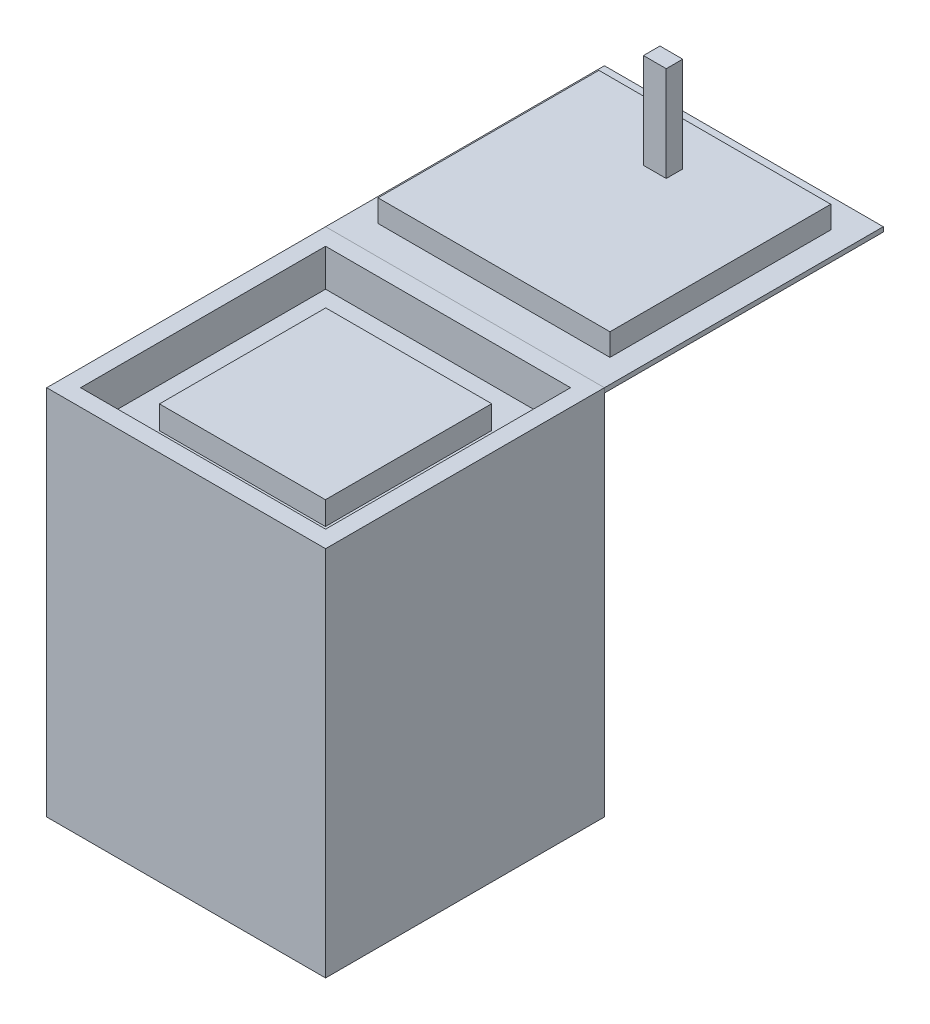
ISO-10303-21;
HEADER;
FILE_DESCRIPTION(('STEP AP214'),'2;1');
FILE_NAME('part.step','',(''),(''),'','','');
FILE_SCHEMA(('AUTOMOTIVE_DESIGN { 1 0 10303 214 1 1 1 1 }'));
ENDSEC;
DATA;
#1=APPLICATION_CONTEXT('core data for automotive mechanical design processes');
#2=APPLICATION_PROTOCOL_DEFINITION('international standard','automotive_design',2000,#1);
#3=PRODUCT_CONTEXT('',#1,'mechanical');
#4=PRODUCT('Part','Part','',(#3));
#5=PRODUCT_RELATED_PRODUCT_CATEGORY('part','',(#4));
#6=PRODUCT_DEFINITION_FORMATION('','',#4);
#7=PRODUCT_DEFINITION_CONTEXT('part definition',#1,'design');
#8=PRODUCT_DEFINITION('design','',#6,#7);
#9=PRODUCT_DEFINITION_SHAPE('','',#8);
#10=(LENGTH_UNIT() NAMED_UNIT(*) SI_UNIT(.MILLI.,.METRE.));
#11=(NAMED_UNIT(*) PLANE_ANGLE_UNIT() SI_UNIT($,.RADIAN.));
#12=(NAMED_UNIT(*) SI_UNIT($,.STERADIAN.) SOLID_ANGLE_UNIT());
#13=UNCERTAINTY_MEASURE_WITH_UNIT(LENGTH_MEASURE(1.E-05),#10,'distance_accuracy_value','');
#14=(GEOMETRIC_REPRESENTATION_CONTEXT(3) GLOBAL_UNCERTAINTY_ASSIGNED_CONTEXT((#13)) GLOBAL_UNIT_ASSIGNED_CONTEXT((#10,
#11,#12)) REPRESENTATION_CONTEXT('',''));
#15=CARTESIAN_POINT('',(0.,0.,0.));
#16=DIRECTION('',(0.,0.,1.));
#17=DIRECTION('',(1.,0.,0.));
#18=AXIS2_PLACEMENT_3D('',#15,#16,#17);
#19=CARTESIAN_POINT('',(249.5,847.834663464303,-362.405670059009));
#20=DIRECTION('',(0.,-1.,0.));
#21=DIRECTION('',(0.,0.,-1.));
#22=AXIS2_PLACEMENT_3D('',#19,#20,#21);
#23=PLANE('',#22);
#24=DIRECTION('',(-1.,0.,0.));
#25=VECTOR('',#24,1.);
#26=CARTESIAN_POINT('',(24.5,847.834663464303,-743.98579561663));
#27=LINE('',#26,#25);
#28=CARTESIAN_POINT('',(24.5,847.834663464303,-743.98579561663));
#29=VERTEX_POINT('',#28);
#30=CARTESIAN_POINT('',(-24.5,847.834663464303,-743.98579561663));
#31=VERTEX_POINT('',#30);
#32=EDGE_CURVE('E64',#29,#31,#27,.T.);
#33=ORIENTED_EDGE('',*,*,#32,.F.);
#34=DIRECTION('',(0.,0.,-1.));
#35=VECTOR('',#34,1.);
#36=CARTESIAN_POINT('',(24.5,847.834663464303,-743.98579561663));
#37=LINE('',#36,#35);
#38=CARTESIAN_POINT('',(24.5,847.834663464303,-708.477622322408));
#39=VERTEX_POINT('',#38);
#40=EDGE_CURVE('E68',#39,#29,#37,.T.);
#41=ORIENTED_EDGE('',*,*,#40,.F.);
#42=DIRECTION('',(-1.,0.,0.));
#43=VECTOR('',#42,1.);
#44=CARTESIAN_POINT('',(24.5,847.834663464303,-708.477622322408));
#45=LINE('',#44,#43);
#46=CARTESIAN_POINT('',(-24.5,847.834663464303,-708.477622322408));
#47=VERTEX_POINT('',#46);
#48=EDGE_CURVE('E138',#39,#47,#45,.T.);
#49=ORIENTED_EDGE('',*,*,#48,.T.);
#50=DIRECTION('',(0.,0.,-1.));
#51=VECTOR('',#50,1.);
#52=CARTESIAN_POINT('',(-24.5,847.834663464303,-743.98579561663));
#53=LINE('',#52,#51);
#54=EDGE_CURVE('E128',#47,#31,#53,.T.);
#55=ORIENTED_EDGE('',*,*,#54,.T.);
#56=EDGE_LOOP('',(#33,#41,#49,#55));
#57=FACE_BOUND('',#56,.T.);
#58=DIRECTION('',(0.,0.,1.));
#59=VECTOR('',#58,1.);
#60=CARTESIAN_POINT('',(-249.5,847.834663464303,-362.405670059009));
#61=LINE('',#60,#59);
#62=CARTESIAN_POINT('',(-249.5,847.834663464303,-837.594329940991));
#63=VERTEX_POINT('',#62);
#64=CARTESIAN_POINT('',(-249.5,847.834663464303,-362.405670059009));
#65=VERTEX_POINT('',#64);
#66=EDGE_CURVE('E133',#63,#65,#61,.T.);
#67=ORIENTED_EDGE('',*,*,#66,.T.);
#68=DIRECTION('',(-1.,0.,0.));
#69=VECTOR('',#68,1.);
#70=CARTESIAN_POINT('',(249.5,847.834663464303,-362.405670059009));
#71=LINE('',#70,#69);
#72=CARTESIAN_POINT('',(249.5,847.834663464303,-362.405670059009));
#73=VERTEX_POINT('',#72);
#74=EDGE_CURVE('E12',#73,#65,#71,.T.);
#75=ORIENTED_EDGE('',*,*,#74,.F.);
#76=DIRECTION('',(0.,0.,1.));
#77=VECTOR('',#76,1.);
#78=CARTESIAN_POINT('',(249.5,847.834663464303,-362.405670059009));
#79=LINE('',#78,#77);
#80=CARTESIAN_POINT('',(249.5,847.834663464303,-837.594329940991));
#81=VERTEX_POINT('',#80);
#82=EDGE_CURVE('E142',#81,#73,#79,.T.);
#83=ORIENTED_EDGE('',*,*,#82,.F.);
#84=DIRECTION('',(-1.,0.,0.));
#85=VECTOR('',#84,1.);
#86=CARTESIAN_POINT('',(249.5,847.834663464303,-837.594329940991));
#87=LINE('',#86,#85);
#88=EDGE_CURVE('E151',#81,#63,#87,.T.);
#89=ORIENTED_EDGE('',*,*,#88,.T.);
#90=EDGE_LOOP('',(#67,#75,#83,#89));
#91=FACE_BOUND('',#90,.T.);
#92=ADVANCED_FACE('F50',(#57,#91),#23,.F.);
#93=CARTESIAN_POINT('',(249.5,800.,-362.405670059009));
#94=DIRECTION('',(0.,0.,-1.));
#95=DIRECTION('',(-1.,0.,0.));
#96=AXIS2_PLACEMENT_3D('',#93,#94,#95);
#97=PLANE('',#96);
#98=DIRECTION('',(0.,-1.,0.));
#99=VECTOR('',#98,1.);
#100=CARTESIAN_POINT('',(-249.5,800.,-362.405670059009));
#101=LINE('',#100,#99);
#102=CARTESIAN_POINT('',(-249.5,800.,-362.405670059009));
#103=VERTEX_POINT('',#102);
#104=EDGE_CURVE('E136',#65,#103,#101,.T.);
#105=ORIENTED_EDGE('',*,*,#104,.T.);
#106=DIRECTION('',(-1.,0.,0.));
#107=VECTOR('',#106,1.);
#108=CARTESIAN_POINT('',(249.5,800.,-362.405670059009));
#109=LINE('',#108,#107);
#110=CARTESIAN_POINT('',(249.5,800.,-362.405670059009));
#111=VERTEX_POINT('',#110);
#112=EDGE_CURVE('E57',#111,#103,#109,.T.);
#113=ORIENTED_EDGE('',*,*,#112,.F.);
#114=DIRECTION('',(0.,-1.,0.));
#115=VECTOR('',#114,1.);
#116=CARTESIAN_POINT('',(249.5,800.,-362.405670059009));
#117=LINE('',#116,#115);
#118=EDGE_CURVE('E145',#73,#111,#117,.T.);
#119=ORIENTED_EDGE('',*,*,#118,.F.);
#120=ORIENTED_EDGE('',*,*,#74,.T.);
#121=EDGE_LOOP('',(#105,#113,#119,#120));
#122=FACE_BOUND('',#121,.T.);
#123=ADVANCED_FACE('F182',(#122),#97,.F.);
#124=CARTESIAN_POINT('',(249.5,800.,-362.405670059009));
#125=DIRECTION('',(0.,1.,0.));
#126=DIRECTION('',(0.,0.,1.));
#127=AXIS2_PLACEMENT_3D('',#124,#125,#126);
#128=PLANE('',#127);
#129=DIRECTION('',(0.,0.,-1.));
#130=VECTOR('',#129,1.);
#131=CARTESIAN_POINT('',(-249.5,800.,-362.405670059009));
#132=LINE('',#131,#130);
#133=CARTESIAN_POINT('',(-249.5,800.,-837.594329940991));
#134=VERTEX_POINT('',#133);
#135=EDGE_CURVE('E154',#103,#134,#132,.T.);
#136=ORIENTED_EDGE('',*,*,#135,.T.);
#137=DIRECTION('',(-1.,0.,0.));
#138=VECTOR('',#137,1.);
#139=CARTESIAN_POINT('',(249.5,800.,-837.594329940991));
#140=LINE('',#139,#138);
#141=CARTESIAN_POINT('',(249.5,800.,-837.594329940991));
#142=VERTEX_POINT('',#141);
#143=EDGE_CURVE('E159',#142,#134,#140,.T.);
#144=ORIENTED_EDGE('',*,*,#143,.F.);
#145=DIRECTION('',(0.,0.,-1.));
#146=VECTOR('',#145,1.);
#147=CARTESIAN_POINT('',(249.5,800.,-362.405670059009));
#148=LINE('',#147,#146);
#149=EDGE_CURVE('E148',#111,#142,#148,.T.);
#150=ORIENTED_EDGE('',*,*,#149,.F.);
#151=ORIENTED_EDGE('',*,*,#112,.T.);
#152=EDGE_LOOP('',(#136,#144,#150,#151));
#153=FACE_BOUND('',#152,.T.);
#154=ADVANCED_FACE('F166',(#153),#128,.F.);
#155=CARTESIAN_POINT('',(249.5,800.,-837.594329940991));
#156=DIRECTION('',(0.,0.,1.));
#157=DIRECTION('',(1.,0.,0.));
#158=AXIS2_PLACEMENT_3D('',#155,#156,#157);
#159=PLANE('',#158);
#160=DIRECTION('',(0.,1.,0.));
#161=VECTOR('',#160,1.);
#162=CARTESIAN_POINT('',(-249.5,800.,-837.594329940991));
#163=LINE('',#162,#161);
#164=EDGE_CURVE('E146',#134,#63,#163,.T.);
#165=ORIENTED_EDGE('',*,*,#164,.T.);
#166=ORIENTED_EDGE('',*,*,#88,.F.);
#167=DIRECTION('',(0.,1.,0.));
#168=VECTOR('',#167,1.);
#169=CARTESIAN_POINT('',(249.5,800.,-837.594329940991));
#170=LINE('',#169,#168);
#171=EDGE_CURVE('E150',#142,#81,#170,.T.);
#172=ORIENTED_EDGE('',*,*,#171,.F.);
#173=ORIENTED_EDGE('',*,*,#143,.T.);
#174=EDGE_LOOP('',(#165,#166,#172,#173));
#175=FACE_BOUND('',#174,.T.);
#176=ADVANCED_FACE('F175',(#175),#159,.F.);
#177=CARTESIAN_POINT('',(249.5,0.,0.));
#178=DIRECTION('',(1.,0.,0.));
#179=DIRECTION('',(0.,0.,-1.));
#180=AXIS2_PLACEMENT_3D('',#177,#178,#179);
#181=PLANE('',#180);
#182=ORIENTED_EDGE('',*,*,#82,.T.);
#183=ORIENTED_EDGE('',*,*,#118,.T.);
#184=ORIENTED_EDGE('',*,*,#149,.T.);
#185=ORIENTED_EDGE('',*,*,#171,.T.);
#186=EDGE_LOOP('',(#182,#183,#184,#185));
#187=FACE_BOUND('',#186,.T.);
#188=ADVANCED_FACE('F181',(#187),#181,.T.);
#189=CARTESIAN_POINT('',(-249.5,0.,0.));
#190=DIRECTION('',(1.,0.,0.));
#191=DIRECTION('',(0.,0.,-1.));
#192=AXIS2_PLACEMENT_3D('',#189,#190,#191);
#193=PLANE('',#192);
#194=ORIENTED_EDGE('',*,*,#66,.F.);
#195=ORIENTED_EDGE('',*,*,#164,.F.);
#196=ORIENTED_EDGE('',*,*,#135,.F.);
#197=ORIENTED_EDGE('',*,*,#104,.F.);
#198=EDGE_LOOP('',(#194,#195,#196,#197));
#199=FACE_BOUND('',#198,.T.);
#200=ADVANCED_FACE('F172',(#199),#193,.F.);
#201=CARTESIAN_POINT('',(24.5,847.834663464303,-743.98579561663));
#202=DIRECTION('',(0.,0.,1.));
#203=DIRECTION('',(1.,0.,0.));
#204=AXIS2_PLACEMENT_3D('',#201,#202,#203);
#205=PLANE('',#204);
#206=DIRECTION('',(0.,1.,0.));
#207=VECTOR('',#206,1.);
#208=CARTESIAN_POINT('',(-24.5,847.834663464303,-743.98579561663));
#209=LINE('',#208,#207);
#210=CARTESIAN_POINT('',(-24.5,1052.5,-743.98579561663));
#211=VERTEX_POINT('',#210);
#212=EDGE_CURVE('E132',#31,#211,#209,.T.);
#213=ORIENTED_EDGE('',*,*,#212,.T.);
#214=DIRECTION('',(-1.,0.,0.));
#215=VECTOR('',#214,1.);
#216=CARTESIAN_POINT('',(24.5,1052.5,-743.98579561663));
#217=LINE('',#216,#215);
#218=CARTESIAN_POINT('',(24.5,1052.5,-743.98579561663));
#219=VERTEX_POINT('',#218);
#220=EDGE_CURVE('E116',#219,#211,#217,.T.);
#221=ORIENTED_EDGE('',*,*,#220,.F.);
#222=DIRECTION('',(0.,1.,0.));
#223=VECTOR('',#222,1.);
#224=CARTESIAN_POINT('',(24.5,847.834663464303,-743.98579561663));
#225=LINE('',#224,#223);
#226=EDGE_CURVE('E123',#29,#219,#225,.T.);
#227=ORIENTED_EDGE('',*,*,#226,.F.);
#228=ORIENTED_EDGE('',*,*,#32,.T.);
#229=EDGE_LOOP('',(#213,#221,#227,#228));
#230=FACE_BOUND('',#229,.T.);
#231=ADVANCED_FACE('F130',(#230),#205,.F.);
#232=CARTESIAN_POINT('',(24.5,1052.5,-743.98579561663));
#233=DIRECTION('',(0.,-1.,0.));
#234=DIRECTION('',(0.,0.,-1.));
#235=AXIS2_PLACEMENT_3D('',#232,#233,#234);
#236=PLANE('',#235);
#237=DIRECTION('',(0.,0.,1.));
#238=VECTOR('',#237,1.);
#239=CARTESIAN_POINT('',(-24.5,1052.5,-743.98579561663));
#240=LINE('',#239,#238);
#241=CARTESIAN_POINT('',(-24.5,1052.5,-708.477622322408));
#242=VERTEX_POINT('',#241);
#243=EDGE_CURVE('E275',#211,#242,#240,.T.);
#244=ORIENTED_EDGE('',*,*,#243,.T.);
#245=DIRECTION('',(-1.,0.,0.));
#246=VECTOR('',#245,1.);
#247=CARTESIAN_POINT('',(24.5,1052.5,-708.477622322408));
#248=LINE('',#247,#246);
#249=CARTESIAN_POINT('',(24.5,1052.5,-708.477622322408));
#250=VERTEX_POINT('',#249);
#251=EDGE_CURVE('E119',#250,#242,#248,.T.);
#252=ORIENTED_EDGE('',*,*,#251,.F.);
#253=DIRECTION('',(0.,0.,1.));
#254=VECTOR('',#253,1.);
#255=CARTESIAN_POINT('',(24.5,1052.5,-743.98579561663));
#256=LINE('',#255,#254);
#257=EDGE_CURVE('E112',#219,#250,#256,.T.);
#258=ORIENTED_EDGE('',*,*,#257,.F.);
#259=ORIENTED_EDGE('',*,*,#220,.T.);
#260=EDGE_LOOP('',(#244,#252,#258,#259));
#261=FACE_BOUND('',#260,.T.);
#262=ADVANCED_FACE('F114',(#261),#236,.F.);
#263=CARTESIAN_POINT('',(24.5,847.834663464303,-708.477622322408));
#264=DIRECTION('',(0.,0.,-1.));
#265=DIRECTION('',(-1.,0.,0.));
#266=AXIS2_PLACEMENT_3D('',#263,#264,#265);
#267=PLANE('',#266);
#268=DIRECTION('',(0.,-1.,0.));
#269=VECTOR('',#268,1.);
#270=CARTESIAN_POINT('',(-24.5,847.834663464303,-708.477622322408));
#271=LINE('',#270,#269);
#272=EDGE_CURVE('E277',#242,#47,#271,.T.);
#273=ORIENTED_EDGE('',*,*,#272,.T.);
#274=ORIENTED_EDGE('',*,*,#48,.F.);
#275=DIRECTION('',(0.,-1.,0.));
#276=VECTOR('',#275,1.);
#277=CARTESIAN_POINT('',(24.5,847.834663464303,-708.477622322408));
#278=LINE('',#277,#276);
#279=EDGE_CURVE('E122',#250,#39,#278,.T.);
#280=ORIENTED_EDGE('',*,*,#279,.F.);
#281=ORIENTED_EDGE('',*,*,#251,.T.);
#282=EDGE_LOOP('',(#273,#274,#280,#281));
#283=FACE_BOUND('',#282,.T.);
#284=ADVANCED_FACE('F200',(#283),#267,.F.);
#285=CARTESIAN_POINT('',(24.5,0.,0.));
#286=DIRECTION('',(1.,0.,0.));
#287=DIRECTION('',(0.,0.,-1.));
#288=AXIS2_PLACEMENT_3D('',#285,#286,#287);
#289=PLANE('',#288);
#290=ORIENTED_EDGE('',*,*,#226,.T.);
#291=ORIENTED_EDGE('',*,*,#257,.T.);
#292=ORIENTED_EDGE('',*,*,#279,.T.);
#293=ORIENTED_EDGE('',*,*,#40,.T.);
#294=EDGE_LOOP('',(#290,#291,#292,#293));
#295=FACE_BOUND('',#294,.T.);
#296=ADVANCED_FACE('F126',(#295),#289,.T.);
#297=CARTESIAN_POINT('',(-24.5,0.,0.));
#298=DIRECTION('',(1.,0.,0.));
#299=DIRECTION('',(0.,0.,-1.));
#300=AXIS2_PLACEMENT_3D('',#297,#298,#299);
#301=PLANE('',#300);
#302=ORIENTED_EDGE('',*,*,#212,.F.);
#303=ORIENTED_EDGE('',*,*,#54,.F.);
#304=ORIENTED_EDGE('',*,*,#272,.F.);
#305=ORIENTED_EDGE('',*,*,#243,.F.);
#306=EDGE_LOOP('',(#302,#303,#304,#305));
#307=FACE_BOUND('',#306,.T.);
#308=ADVANCED_FACE('F204',(#307),#301,.F.);
#309=CLOSED_SHELL('',(#92,#123,#154,#176,#188,#200,#231,#262,#284,#296,#308));
#310=MANIFOLD_SOLID_BREP('B2',#309);
#311=CARTESIAN_POINT('',(300.,790.,-300.));
#312=DIRECTION('',(1.,0.,0.));
#313=DIRECTION('',(0.,0.,-1.));
#314=AXIS2_PLACEMENT_3D('',#311,#312,#313);
#315=PLANE('',#314);
#316=DIRECTION('',(0.,0.,-1.));
#317=VECTOR('',#316,1.);
#318=CARTESIAN_POINT('',(300.,800.,-300.));
#319=LINE('',#318,#317);
#320=CARTESIAN_POINT('',(300.,800.,-300.));
#321=VERTEX_POINT('',#320);
#322=CARTESIAN_POINT('',(300.,800.,-900.));
#323=VERTEX_POINT('',#322);
#324=EDGE_CURVE('E362',#321,#323,#319,.T.);
#325=ORIENTED_EDGE('',*,*,#324,.F.);
#326=DIRECTION('',(0.,1.,0.));
#327=VECTOR('',#326,1.);
#328=CARTESIAN_POINT('',(300.,790.,-300.));
#329=LINE('',#328,#327);
#330=CARTESIAN_POINT('',(300.,790.,-300.));
#331=VERTEX_POINT('',#330);
#332=EDGE_CURVE('E48',#331,#321,#329,.T.);
#333=ORIENTED_EDGE('',*,*,#332,.F.);
#334=DIRECTION('',(0.,0.,-1.));
#335=VECTOR('',#334,1.);
#336=CARTESIAN_POINT('',(300.,790.,-300.));
#337=LINE('',#336,#335);
#338=CARTESIAN_POINT('',(300.,790.,-900.));
#339=VERTEX_POINT('',#338);
#340=EDGE_CURVE('E356',#331,#339,#337,.T.);
#341=ORIENTED_EDGE('',*,*,#340,.T.);
#342=DIRECTION('',(0.,1.,0.));
#343=VECTOR('',#342,1.);
#344=CARTESIAN_POINT('',(300.,790.,-900.));
#345=LINE('',#344,#343);
#346=EDGE_CURVE('E301',#339,#323,#345,.T.);
#347=ORIENTED_EDGE('',*,*,#346,.T.);
#348=EDGE_LOOP('',(#325,#333,#341,#347));
#349=FACE_BOUND('',#348,.T.);
#350=ADVANCED_FACE('F298',(#349),#315,.T.);
#351=CARTESIAN_POINT('',(300.,790.,-300.));
#352=DIRECTION('',(0.,0.,1.));
#353=DIRECTION('',(1.,0.,0.));
#354=AXIS2_PLACEMENT_3D('',#351,#352,#353);
#355=PLANE('',#354);
#356=DIRECTION('',(1.,0.,0.));
#357=VECTOR('',#356,1.);
#358=CARTESIAN_POINT('',(300.,800.,-300.));
#359=LINE('',#358,#357);
#360=CARTESIAN_POINT('',(-300.,800.,-300.));
#361=VERTEX_POINT('',#360);
#362=EDGE_CURVE('E358',#361,#321,#359,.T.);
#363=ORIENTED_EDGE('',*,*,#362,.F.);
#364=DIRECTION('',(0.,1.,0.));
#365=VECTOR('',#364,1.);
#366=CARTESIAN_POINT('',(-300.,790.,-300.));
#367=LINE('',#366,#365);
#368=CARTESIAN_POINT('',(-300.,790.,-300.));
#369=VERTEX_POINT('',#368);
#370=EDGE_CURVE('E307',#369,#361,#367,.T.);
#371=ORIENTED_EDGE('',*,*,#370,.F.);
#372=DIRECTION('',(1.,0.,0.));
#373=VECTOR('',#372,1.);
#374=CARTESIAN_POINT('',(300.,790.,-300.));
#375=LINE('',#374,#373);
#376=EDGE_CURVE('E353',#369,#331,#375,.T.);
#377=ORIENTED_EDGE('',*,*,#376,.T.);
#378=ORIENTED_EDGE('',*,*,#332,.T.);
#379=EDGE_LOOP('',(#363,#371,#377,#378));
#380=FACE_BOUND('',#379,.T.);
#381=ADVANCED_FACE('F372',(#380),#355,.T.);
#382=CARTESIAN_POINT('',(-300.,790.,-300.));
#383=DIRECTION('',(-1.,0.,0.));
#384=DIRECTION('',(0.,0.,1.));
#385=AXIS2_PLACEMENT_3D('',#382,#383,#384);
#386=PLANE('',#385);
#387=DIRECTION('',(0.,0.,1.));
#388=VECTOR('',#387,1.);
#389=CARTESIAN_POINT('',(-300.,800.,-300.));
#390=LINE('',#389,#388);
#391=CARTESIAN_POINT('',(-300.,800.,-900.));
#392=VERTEX_POINT('',#391);
#393=EDGE_CURVE('E348',#392,#361,#390,.T.);
#394=ORIENTED_EDGE('',*,*,#393,.F.);
#395=DIRECTION('',(0.,1.,0.));
#396=VECTOR('',#395,1.);
#397=CARTESIAN_POINT('',(-300.,790.,-900.));
#398=LINE('',#397,#396);
#399=CARTESIAN_POINT('',(-300.,790.,-900.));
#400=VERTEX_POINT('',#399);
#401=EDGE_CURVE('E343',#400,#392,#398,.T.);
#402=ORIENTED_EDGE('',*,*,#401,.F.);
#403=DIRECTION('',(0.,0.,1.));
#404=VECTOR('',#403,1.);
#405=CARTESIAN_POINT('',(-300.,790.,-300.));
#406=LINE('',#405,#404);
#407=EDGE_CURVE('E346',#400,#369,#406,.T.);
#408=ORIENTED_EDGE('',*,*,#407,.T.);
#409=ORIENTED_EDGE('',*,*,#370,.T.);
#410=EDGE_LOOP('',(#394,#402,#408,#409));
#411=FACE_BOUND('',#410,.T.);
#412=ADVANCED_FACE('F345',(#411),#386,.T.);
#413=CARTESIAN_POINT('',(300.,790.,-900.));
#414=DIRECTION('',(0.,0.,-1.));
#415=DIRECTION('',(-1.,0.,0.));
#416=AXIS2_PLACEMENT_3D('',#413,#414,#415);
#417=PLANE('',#416);
#418=DIRECTION('',(-1.,0.,0.));
#419=VECTOR('',#418,1.);
#420=CARTESIAN_POINT('',(300.,800.,-900.));
#421=LINE('',#420,#419);
#422=EDGE_CURVE('E365',#323,#392,#421,.T.);
#423=ORIENTED_EDGE('',*,*,#422,.F.);
#424=ORIENTED_EDGE('',*,*,#346,.F.);
#425=DIRECTION('',(-1.,0.,0.));
#426=VECTOR('',#425,1.);
#427=CARTESIAN_POINT('',(300.,790.,-900.));
#428=LINE('',#427,#426);
#429=EDGE_CURVE('E352',#339,#400,#428,.T.);
#430=ORIENTED_EDGE('',*,*,#429,.T.);
#431=ORIENTED_EDGE('',*,*,#401,.T.);
#432=EDGE_LOOP('',(#423,#424,#430,#431));
#433=FACE_BOUND('',#432,.T.);
#434=ADVANCED_FACE('F355',(#433),#417,.T.);
#435=CARTESIAN_POINT('',(0.,790.,0.));
#436=DIRECTION('',(0.,1.,0.));
#437=DIRECTION('',(0.,0.,1.));
#438=AXIS2_PLACEMENT_3D('',#435,#436,#437);
#439=PLANE('',#438);
#440=ORIENTED_EDGE('',*,*,#340,.F.);
#441=ORIENTED_EDGE('',*,*,#376,.F.);
#442=ORIENTED_EDGE('',*,*,#407,.F.);
#443=ORIENTED_EDGE('',*,*,#429,.F.);
#444=EDGE_LOOP('',(#440,#441,#442,#443));
#445=FACE_BOUND('',#444,.T.);
#446=ADVANCED_FACE('F351',(#445),#439,.F.);
#447=CARTESIAN_POINT('',(0.,800.,0.));
#448=DIRECTION('',(0.,1.,0.));
#449=DIRECTION('',(0.,0.,1.));
#450=AXIS2_PLACEMENT_3D('',#447,#448,#449);
#451=PLANE('',#450);
#452=ORIENTED_EDGE('',*,*,#324,.T.);
#453=ORIENTED_EDGE('',*,*,#422,.T.);
#454=ORIENTED_EDGE('',*,*,#393,.T.);
#455=ORIENTED_EDGE('',*,*,#362,.T.);
#456=EDGE_LOOP('',(#452,#453,#454,#455));
#457=FACE_BOUND('',#456,.T.);
#458=ADVANCED_FACE('F371',(#457),#451,.T.);
#459=CLOSED_SHELL('',(#350,#381,#412,#434,#446,#458));
#460=MANIFOLD_SOLID_BREP('B6',#459);
#461=CARTESIAN_POINT('',(0.,720.,0.));
#462=DIRECTION('',(0.,-1.,0.));
#463=DIRECTION('',(0.,0.,-1.));
#464=AXIS2_PLACEMENT_3D('',#461,#462,#463);
#465=PLANE('',#464);
#466=DIRECTION('',(0.,0.,-1.));
#467=VECTOR('',#466,1.);
#468=CARTESIAN_POINT('',(263.572920461232,720.,263.572920461232));
#469=LINE('',#468,#467);
#470=CARTESIAN_POINT('',(263.572920461232,720.,263.572920461232));
#471=VERTEX_POINT('',#470);
#472=CARTESIAN_POINT('',(263.572920461232,720.,-263.572920461232));
#473=VERTEX_POINT('',#472);
#474=EDGE_CURVE('E540',#471,#473,#469,.T.);
#475=ORIENTED_EDGE('',*,*,#474,.T.);
#476=DIRECTION('',(-1.,0.,0.));
#477=VECTOR('',#476,1.);
#478=CARTESIAN_POINT('',(-263.572920461232,720.,-263.572920461232));
#479=LINE('',#478,#477);
#480=CARTESIAN_POINT('',(-263.572920461232,720.,-263.572920461232));
#481=VERTEX_POINT('',#480);
#482=EDGE_CURVE('E543',#473,#481,#479,.T.);
#483=ORIENTED_EDGE('',*,*,#482,.T.);
#484=DIRECTION('',(0.,0.,1.));
#485=VECTOR('',#484,1.);
#486=CARTESIAN_POINT('',(-263.572920461232,720.,263.572920461232));
#487=LINE('',#486,#485);
#488=CARTESIAN_POINT('',(-263.572920461232,720.,263.572920461232));
#489=VERTEX_POINT('',#488);
#490=EDGE_CURVE('E547',#481,#489,#487,.T.);
#491=ORIENTED_EDGE('',*,*,#490,.T.);
#492=DIRECTION('',(1.,0.,0.));
#493=VECTOR('',#492,1.);
#494=CARTESIAN_POINT('',(-263.572920461232,720.,263.572920461232));
#495=LINE('',#494,#493);
#496=EDGE_CURVE('E550',#489,#471,#495,.T.);
#497=ORIENTED_EDGE('',*,*,#496,.T.);
#498=EDGE_LOOP('',(#475,#483,#491,#497));
#499=FACE_BOUND('',#498,.T.);
#500=DIRECTION('',(0.,0.,-1.));
#501=VECTOR('',#500,1.);
#502=CARTESIAN_POINT('',(178.559538280961,720.,178.911726719381));
#503=LINE('',#502,#501);
#504=CARTESIAN_POINT('',(178.559538280961,720.,178.911726719381));
#505=VERTEX_POINT('',#504);
#506=CARTESIAN_POINT('',(178.559538280961,720.,-178.911726719381));
#507=VERTEX_POINT('',#506);
#508=EDGE_CURVE('E531',#505,#507,#503,.T.);
#509=ORIENTED_EDGE('',*,*,#508,.F.);
#510=DIRECTION('',(1.,0.,0.));
#511=VECTOR('',#510,1.);
#512=CARTESIAN_POINT('',(-178.559538280961,720.,178.911726719381));
#513=LINE('',#512,#511);
#514=CARTESIAN_POINT('',(-178.559538280961,720.,178.911726719381));
#515=VERTEX_POINT('',#514);
#516=EDGE_CURVE('E528',#515,#505,#513,.T.);
#517=ORIENTED_EDGE('',*,*,#516,.F.);
#518=DIRECTION('',(0.,0.,1.));
#519=VECTOR('',#518,1.);
#520=CARTESIAN_POINT('',(-178.559538280961,720.,178.911726719381));
#521=LINE('',#520,#519);
#522=CARTESIAN_POINT('',(-178.559538280961,720.,-178.911726719381));
#523=VERTEX_POINT('',#522);
#524=EDGE_CURVE('E442',#523,#515,#521,.T.);
#525=ORIENTED_EDGE('',*,*,#524,.F.);
#526=DIRECTION('',(-1.,0.,0.));
#527=VECTOR('',#526,1.);
#528=CARTESIAN_POINT('',(-178.559538280961,720.,-178.911726719381));
#529=LINE('',#528,#527);
#530=EDGE_CURVE('E437',#507,#523,#529,.T.);
#531=ORIENTED_EDGE('',*,*,#530,.F.);
#532=EDGE_LOOP('',(#509,#517,#525,#531));
#533=FACE_BOUND('',#532,.T.);
#534=ADVANCED_FACE('F422',(#499,#533),#465,.F.);
#535=CARTESIAN_POINT('',(-300.,800.,-300.));
#536=DIRECTION('',(1.,0.,0.));
#537=DIRECTION('',(0.,0.,-1.));
#538=AXIS2_PLACEMENT_3D('',#535,#536,#537);
#539=PLANE('',#538);
#540=DIRECTION('',(0.,0.,1.));
#541=VECTOR('',#540,1.);
#542=CARTESIAN_POINT('',(-300.,0.,-300.));
#543=LINE('',#542,#541);
#544=CARTESIAN_POINT('',(-300.,0.,-300.));
#545=VERTEX_POINT('',#544);
#546=CARTESIAN_POINT('',(-300.,0.,300.));
#547=VERTEX_POINT('',#546);
#548=EDGE_CURVE('E563',#545,#547,#543,.T.);
#549=ORIENTED_EDGE('',*,*,#548,.T.);
#550=DIRECTION('',(0.,-1.,0.));
#551=VECTOR('',#550,1.);
#552=CARTESIAN_POINT('',(-300.,800.,300.));
#553=LINE('',#552,#551);
#554=CARTESIAN_POINT('',(-300.,800.,300.));
#555=VERTEX_POINT('',#554);
#556=EDGE_CURVE('E296',#555,#547,#553,.T.);
#557=ORIENTED_EDGE('',*,*,#556,.F.);
#558=DIRECTION('',(0.,0.,1.));
#559=VECTOR('',#558,1.);
#560=CARTESIAN_POINT('',(-300.,800.,-300.));
#561=LINE('',#560,#559);
#562=CARTESIAN_POINT('',(-300.,800.,-300.));
#563=VERTEX_POINT('',#562);
#564=EDGE_CURVE('E570',#563,#555,#561,.T.);
#565=ORIENTED_EDGE('',*,*,#564,.F.);
#566=DIRECTION('',(0.,-1.,0.));
#567=VECTOR('',#566,1.);
#568=CARTESIAN_POINT('',(-300.,800.,-300.));
#569=LINE('',#568,#567);
#570=EDGE_CURVE('E580',#563,#545,#569,.T.);
#571=ORIENTED_EDGE('',*,*,#570,.T.);
#572=EDGE_LOOP('',(#549,#557,#565,#571));
#573=FACE_BOUND('',#572,.T.);
#574=ADVANCED_FACE('F424',(#573),#539,.F.);
#575=CARTESIAN_POINT('',(300.,800.,300.));
#576=DIRECTION('',(0.,0.,-1.));
#577=DIRECTION('',(-1.,0.,0.));
#578=AXIS2_PLACEMENT_3D('',#575,#576,#577);
#579=PLANE('',#578);
#580=DIRECTION('',(1.,0.,0.));
#581=VECTOR('',#580,1.);
#582=CARTESIAN_POINT('',(300.,0.,300.));
#583=LINE('',#582,#581);
#584=CARTESIAN_POINT('',(300.,0.,300.));
#585=VERTEX_POINT('',#584);
#586=EDGE_CURVE('E583',#547,#585,#583,.T.);
#587=ORIENTED_EDGE('',*,*,#586,.T.);
#588=DIRECTION('',(0.,-1.,0.));
#589=VECTOR('',#588,1.);
#590=CARTESIAN_POINT('',(300.,800.,300.));
#591=LINE('',#590,#589);
#592=CARTESIAN_POINT('',(300.,800.,300.));
#593=VERTEX_POINT('',#592);
#594=EDGE_CURVE('E430',#593,#585,#591,.T.);
#595=ORIENTED_EDGE('',*,*,#594,.F.);
#596=DIRECTION('',(1.,0.,0.));
#597=VECTOR('',#596,1.);
#598=CARTESIAN_POINT('',(300.,800.,300.));
#599=LINE('',#598,#597);
#600=EDGE_CURVE('E573',#555,#593,#599,.T.);
#601=ORIENTED_EDGE('',*,*,#600,.F.);
#602=ORIENTED_EDGE('',*,*,#556,.T.);
#603=EDGE_LOOP('',(#587,#595,#601,#602));
#604=FACE_BOUND('',#603,.T.);
#605=ADVANCED_FACE('F613',(#604),#579,.F.);
#606=CARTESIAN_POINT('',(300.,800.,-300.));
#607=DIRECTION('',(-1.,0.,0.));
#608=DIRECTION('',(0.,0.,1.));
#609=AXIS2_PLACEMENT_3D('',#606,#607,#608);
#610=PLANE('',#609);
#611=DIRECTION('',(0.,0.,-1.));
#612=VECTOR('',#611,1.);
#613=CARTESIAN_POINT('',(300.,0.,-300.));
#614=LINE('',#613,#612);
#615=CARTESIAN_POINT('',(300.,0.,-300.));
#616=VERTEX_POINT('',#615);
#617=EDGE_CURVE('E585',#585,#616,#614,.T.);
#618=ORIENTED_EDGE('',*,*,#617,.T.);
#619=DIRECTION('',(0.,-1.,0.));
#620=VECTOR('',#619,1.);
#621=CARTESIAN_POINT('',(300.,800.,-300.));
#622=LINE('',#621,#620);
#623=CARTESIAN_POINT('',(300.,800.,-300.));
#624=VERTEX_POINT('',#623);
#625=EDGE_CURVE('E590',#624,#616,#622,.T.);
#626=ORIENTED_EDGE('',*,*,#625,.F.);
#627=DIRECTION('',(0.,0.,-1.));
#628=VECTOR('',#627,1.);
#629=CARTESIAN_POINT('',(300.,800.,-300.));
#630=LINE('',#629,#628);
#631=EDGE_CURVE('E576',#593,#624,#630,.T.);
#632=ORIENTED_EDGE('',*,*,#631,.F.);
#633=ORIENTED_EDGE('',*,*,#594,.T.);
#634=EDGE_LOOP('',(#618,#626,#632,#633));
#635=FACE_BOUND('',#634,.T.);
#636=ADVANCED_FACE('F597',(#635),#610,.F.);
#637=CARTESIAN_POINT('',(300.,800.,-300.));
#638=DIRECTION('',(0.,0.,1.));
#639=DIRECTION('',(1.,0.,0.));
#640=AXIS2_PLACEMENT_3D('',#637,#638,#639);
#641=PLANE('',#640);
#642=DIRECTION('',(-1.,0.,0.));
#643=VECTOR('',#642,1.);
#644=CARTESIAN_POINT('',(300.,0.,-300.));
#645=LINE('',#644,#643);
#646=EDGE_CURVE('E574',#616,#545,#645,.T.);
#647=ORIENTED_EDGE('',*,*,#646,.T.);
#648=ORIENTED_EDGE('',*,*,#570,.F.);
#649=DIRECTION('',(-1.,0.,0.));
#650=VECTOR('',#649,1.);
#651=CARTESIAN_POINT('',(300.,800.,-300.));
#652=LINE('',#651,#650);
#653=EDGE_CURVE('E578',#624,#563,#652,.T.);
#654=ORIENTED_EDGE('',*,*,#653,.F.);
#655=ORIENTED_EDGE('',*,*,#625,.T.);
#656=EDGE_LOOP('',(#647,#648,#654,#655));
#657=FACE_BOUND('',#656,.T.);
#658=ADVANCED_FACE('F606',(#657),#641,.F.);
#659=CARTESIAN_POINT('',(0.,800.,0.));
#660=DIRECTION('',(0.,-1.,0.));
#661=DIRECTION('',(0.,0.,-1.));
#662=AXIS2_PLACEMENT_3D('',#659,#660,#661);
#663=PLANE('',#662);
#664=DIRECTION('',(-1.,0.,0.));
#665=VECTOR('',#664,1.);
#666=CARTESIAN_POINT('',(-263.572920461232,800.,-263.572920461232));
#667=LINE('',#666,#665);
#668=CARTESIAN_POINT('',(263.572920461232,800.,-263.572920461232));
#669=VERTEX_POINT('',#668);
#670=CARTESIAN_POINT('',(-263.572920461232,800.,-263.572920461232));
#671=VERTEX_POINT('',#670);
#672=EDGE_CURVE('E534',#669,#671,#667,.T.);
#673=ORIENTED_EDGE('',*,*,#672,.F.);
#674=DIRECTION('',(0.,0.,-1.));
#675=VECTOR('',#674,1.);
#676=CARTESIAN_POINT('',(263.572920461232,800.,263.572920461232));
#677=LINE('',#676,#675);
#678=CARTESIAN_POINT('',(263.572920461232,800.,263.572920461232));
#679=VERTEX_POINT('',#678);
#680=EDGE_CURVE('E532',#679,#669,#677,.T.);
#681=ORIENTED_EDGE('',*,*,#680,.F.);
#682=DIRECTION('',(1.,0.,0.));
#683=VECTOR('',#682,1.);
#684=CARTESIAN_POINT('',(-263.572920461232,800.,263.572920461232));
#685=LINE('',#684,#683);
#686=CARTESIAN_POINT('',(-263.572920461232,800.,263.572920461232));
#687=VERTEX_POINT('',#686);
#688=EDGE_CURVE('E544',#687,#679,#685,.T.);
#689=ORIENTED_EDGE('',*,*,#688,.F.);
#690=DIRECTION('',(0.,0.,1.));
#691=VECTOR('',#690,1.);
#692=CARTESIAN_POINT('',(-263.572920461232,800.,263.572920461232));
#693=LINE('',#692,#691);
#694=EDGE_CURVE('E556',#671,#687,#693,.T.);
#695=ORIENTED_EDGE('',*,*,#694,.F.);
#696=EDGE_LOOP('',(#673,#681,#689,#695));
#697=FACE_BOUND('',#696,.T.);
#698=ORIENTED_EDGE('',*,*,#564,.T.);
#699=ORIENTED_EDGE('',*,*,#600,.T.);
#700=ORIENTED_EDGE('',*,*,#631,.T.);
#701=ORIENTED_EDGE('',*,*,#653,.T.);
#702=EDGE_LOOP('',(#698,#699,#700,#701));
#703=FACE_BOUND('',#702,.T.);
#704=ADVANCED_FACE('F612',(#697,#703),#663,.F.);
#705=CARTESIAN_POINT('',(0.,0.,0.));
#706=DIRECTION('',(0.,-1.,0.));
#707=DIRECTION('',(0.,0.,-1.));
#708=AXIS2_PLACEMENT_3D('',#705,#706,#707);
#709=PLANE('',#708);
#710=ORIENTED_EDGE('',*,*,#548,.F.);
#711=ORIENTED_EDGE('',*,*,#646,.F.);
#712=ORIENTED_EDGE('',*,*,#617,.F.);
#713=ORIENTED_EDGE('',*,*,#586,.F.);
#714=EDGE_LOOP('',(#710,#711,#712,#713));
#715=FACE_BOUND('',#714,.T.);
#716=ADVANCED_FACE('F603',(#715),#709,.T.);
#717=CARTESIAN_POINT('',(263.572920461232,720.,263.572920461232));
#718=DIRECTION('',(1.,0.,0.));
#719=DIRECTION('',(0.,0.,-1.));
#720=AXIS2_PLACEMENT_3D('',#717,#718,#719);
#721=PLANE('',#720);
#722=ORIENTED_EDGE('',*,*,#680,.T.);
#723=DIRECTION('',(0.,1.,0.));
#724=VECTOR('',#723,1.);
#725=CARTESIAN_POINT('',(263.572920461232,720.,-263.572920461232));
#726=LINE('',#725,#724);
#727=EDGE_CURVE('E552',#473,#669,#726,.T.);
#728=ORIENTED_EDGE('',*,*,#727,.F.);
#729=ORIENTED_EDGE('',*,*,#474,.F.);
#730=DIRECTION('',(0.,1.,0.));
#731=VECTOR('',#730,1.);
#732=CARTESIAN_POINT('',(263.572920461232,720.,263.572920461232));
#733=LINE('',#732,#731);
#734=EDGE_CURVE('E561',#471,#679,#733,.T.);
#735=ORIENTED_EDGE('',*,*,#734,.T.);
#736=EDGE_LOOP('',(#722,#728,#729,#735));
#737=FACE_BOUND('',#736,.T.);
#738=ADVANCED_FACE('F632',(#737),#721,.F.);
#739=CARTESIAN_POINT('',(-263.572920461232,720.,263.572920461232));
#740=DIRECTION('',(0.,0.,1.));
#741=DIRECTION('',(1.,0.,0.));
#742=AXIS2_PLACEMENT_3D('',#739,#740,#741);
#743=PLANE('',#742);
#744=ORIENTED_EDGE('',*,*,#688,.T.);
#745=ORIENTED_EDGE('',*,*,#734,.F.);
#746=ORIENTED_EDGE('',*,*,#496,.F.);
#747=DIRECTION('',(0.,1.,0.));
#748=VECTOR('',#747,1.);
#749=CARTESIAN_POINT('',(-263.572920461232,720.,263.572920461232));
#750=LINE('',#749,#748);
#751=EDGE_CURVE('E564',#489,#687,#750,.T.);
#752=ORIENTED_EDGE('',*,*,#751,.T.);
#753=EDGE_LOOP('',(#744,#745,#746,#752));
#754=FACE_BOUND('',#753,.T.);
#755=ADVANCED_FACE('F628',(#754),#743,.F.);
#756=CARTESIAN_POINT('',(-263.572920461232,720.,263.572920461232));
#757=DIRECTION('',(-1.,0.,0.));
#758=DIRECTION('',(0.,0.,1.));
#759=AXIS2_PLACEMENT_3D('',#756,#757,#758);
#760=PLANE('',#759);
#761=ORIENTED_EDGE('',*,*,#694,.T.);
#762=ORIENTED_EDGE('',*,*,#751,.F.);
#763=ORIENTED_EDGE('',*,*,#490,.F.);
#764=DIRECTION('',(0.,1.,0.));
#765=VECTOR('',#764,1.);
#766=CARTESIAN_POINT('',(-263.572920461232,720.,-263.572920461232));
#767=LINE('',#766,#765);
#768=EDGE_CURVE('E566',#481,#671,#767,.T.);
#769=ORIENTED_EDGE('',*,*,#768,.T.);
#770=EDGE_LOOP('',(#761,#762,#763,#769));
#771=FACE_BOUND('',#770,.T.);
#772=ADVANCED_FACE('F631',(#771),#760,.F.);
#773=CARTESIAN_POINT('',(-263.572920461232,720.,-263.572920461232));
#774=DIRECTION('',(0.,0.,-1.));
#775=DIRECTION('',(-1.,0.,0.));
#776=AXIS2_PLACEMENT_3D('',#773,#774,#775);
#777=PLANE('',#776);
#778=ORIENTED_EDGE('',*,*,#672,.T.);
#779=ORIENTED_EDGE('',*,*,#768,.F.);
#780=ORIENTED_EDGE('',*,*,#482,.F.);
#781=ORIENTED_EDGE('',*,*,#727,.T.);
#782=EDGE_LOOP('',(#778,#779,#780,#781));
#783=FACE_BOUND('',#782,.T.);
#784=ADVANCED_FACE('F636',(#783),#777,.F.);
#785=CARTESIAN_POINT('',(178.559538280961,770.,178.911726719381));
#786=DIRECTION('',(-1.,0.,0.));
#787=DIRECTION('',(0.,0.,1.));
#788=AXIS2_PLACEMENT_3D('',#785,#786,#787);
#789=PLANE('',#788);
#790=ORIENTED_EDGE('',*,*,#508,.T.);
#791=DIRECTION('',(0.,-1.,0.));
#792=VECTOR('',#791,1.);
#793=CARTESIAN_POINT('',(178.559538280961,770.,-178.911726719381));
#794=LINE('',#793,#792);
#795=CARTESIAN_POINT('',(178.559538280961,770.,-178.911726719381));
#796=VERTEX_POINT('',#795);
#797=EDGE_CURVE('E512',#796,#507,#794,.T.);
#798=ORIENTED_EDGE('',*,*,#797,.F.);
#799=DIRECTION('',(0.,0.,-1.));
#800=VECTOR('',#799,1.);
#801=CARTESIAN_POINT('',(178.559538280961,770.,178.911726719381));
#802=LINE('',#801,#800);
#803=CARTESIAN_POINT('',(178.559538280961,770.,178.911726719381));
#804=VERTEX_POINT('',#803);
#805=EDGE_CURVE('E519',#804,#796,#802,.T.);
#806=ORIENTED_EDGE('',*,*,#805,.F.);
#807=DIRECTION('',(0.,-1.,0.));
#808=VECTOR('',#807,1.);
#809=CARTESIAN_POINT('',(178.559538280961,770.,178.911726719381));
#810=LINE('',#809,#808);
#811=EDGE_CURVE('E771',#804,#505,#810,.T.);
#812=ORIENTED_EDGE('',*,*,#811,.T.);
#813=EDGE_LOOP('',(#790,#798,#806,#812));
#814=FACE_BOUND('',#813,.T.);
#815=ADVANCED_FACE('F530',(#814),#789,.F.);
#816=CARTESIAN_POINT('',(-178.559538280961,770.,-178.911726719381));
#817=DIRECTION('',(0.,0.,1.));
#818=DIRECTION('',(1.,0.,0.));
#819=AXIS2_PLACEMENT_3D('',#816,#817,#818);
#820=PLANE('',#819);
#821=ORIENTED_EDGE('',*,*,#530,.T.);
#822=DIRECTION('',(0.,-1.,0.));
#823=VECTOR('',#822,1.);
#824=CARTESIAN_POINT('',(-178.559538280961,770.,-178.911726719381));
#825=LINE('',#824,#823);
#826=CARTESIAN_POINT('',(-178.559538280961,770.,-178.911726719381));
#827=VERTEX_POINT('',#826);
#828=EDGE_CURVE('E515',#827,#523,#825,.T.);
#829=ORIENTED_EDGE('',*,*,#828,.F.);
#830=DIRECTION('',(-1.,0.,0.));
#831=VECTOR('',#830,1.);
#832=CARTESIAN_POINT('',(-178.559538280961,770.,-178.911726719381));
#833=LINE('',#832,#831);
#834=EDGE_CURVE('E508',#796,#827,#833,.T.);
#835=ORIENTED_EDGE('',*,*,#834,.F.);
#836=ORIENTED_EDGE('',*,*,#797,.T.);
#837=EDGE_LOOP('',(#821,#829,#835,#836));
#838=FACE_BOUND('',#837,.T.);
#839=ADVANCED_FACE('F510',(#838),#820,.F.);
#840=CARTESIAN_POINT('',(-178.559538280961,770.,178.911726719381));
#841=DIRECTION('',(1.,0.,0.));
#842=DIRECTION('',(0.,0.,-1.));
#843=AXIS2_PLACEMENT_3D('',#840,#841,#842);
#844=PLANE('',#843);
#845=ORIENTED_EDGE('',*,*,#524,.T.);
#846=DIRECTION('',(0.,-1.,0.));
#847=VECTOR('',#846,1.);
#848=CARTESIAN_POINT('',(-178.559538280961,770.,178.911726719381));
#849=LINE('',#848,#847);
#850=CARTESIAN_POINT('',(-178.559538280961,770.,178.911726719381));
#851=VERTEX_POINT('',#850);
#852=EDGE_CURVE('E536',#851,#515,#849,.T.);
#853=ORIENTED_EDGE('',*,*,#852,.F.);
#854=DIRECTION('',(0.,0.,1.));
#855=VECTOR('',#854,1.);
#856=CARTESIAN_POINT('',(-178.559538280961,770.,178.911726719381));
#857=LINE('',#856,#855);
#858=EDGE_CURVE('E518',#827,#851,#857,.T.);
#859=ORIENTED_EDGE('',*,*,#858,.F.);
#860=ORIENTED_EDGE('',*,*,#828,.T.);
#861=EDGE_LOOP('',(#845,#853,#859,#860));
#862=FACE_BOUND('',#861,.T.);
#863=ADVANCED_FACE('F689',(#862),#844,.F.);
#864=CARTESIAN_POINT('',(-178.559538280961,770.,178.911726719381));
#865=DIRECTION('',(0.,0.,-1.));
#866=DIRECTION('',(-1.,0.,0.));
#867=AXIS2_PLACEMENT_3D('',#864,#865,#866);
#868=PLANE('',#867);
#869=ORIENTED_EDGE('',*,*,#516,.T.);
#870=ORIENTED_EDGE('',*,*,#811,.F.);
#871=DIRECTION('',(1.,0.,0.));
#872=VECTOR('',#871,1.);
#873=CARTESIAN_POINT('',(-178.559538280961,770.,178.911726719381));
#874=LINE('',#873,#872);
#875=EDGE_CURVE('E524',#851,#804,#874,.T.);
#876=ORIENTED_EDGE('',*,*,#875,.F.);
#877=ORIENTED_EDGE('',*,*,#852,.T.);
#878=EDGE_LOOP('',(#869,#870,#876,#877));
#879=FACE_BOUND('',#878,.T.);
#880=ADVANCED_FACE('F695',(#879),#868,.F.);
#881=CARTESIAN_POINT('',(0.,770.,0.));
#882=DIRECTION('',(0.,-1.,0.));
#883=DIRECTION('',(0.,0.,-1.));
#884=AXIS2_PLACEMENT_3D('',#881,#882,#883);
#885=PLANE('',#884);
#886=ORIENTED_EDGE('',*,*,#805,.T.);
#887=ORIENTED_EDGE('',*,*,#834,.T.);
#888=ORIENTED_EDGE('',*,*,#858,.T.);
#889=ORIENTED_EDGE('',*,*,#875,.T.);
#890=EDGE_LOOP('',(#886,#887,#888,#889));
#891=FACE_BOUND('',#890,.T.);
#892=ADVANCED_FACE('F522',(#891),#885,.F.);
#893=CLOSED_SHELL('',(#534,#574,#605,#636,#658,#704,#716,#738,#755,#772,#784,#815,#839,#863,
#880,#892));
#894=MANIFOLD_SOLID_BREP('B42',#893);
#895=ADVANCED_BREP_SHAPE_REPRESENTATION('',(#18,#310,#460,#894),#14);
#896=SHAPE_DEFINITION_REPRESENTATION(#9,#895);
ENDSEC;
END-ISO-10303-21;
